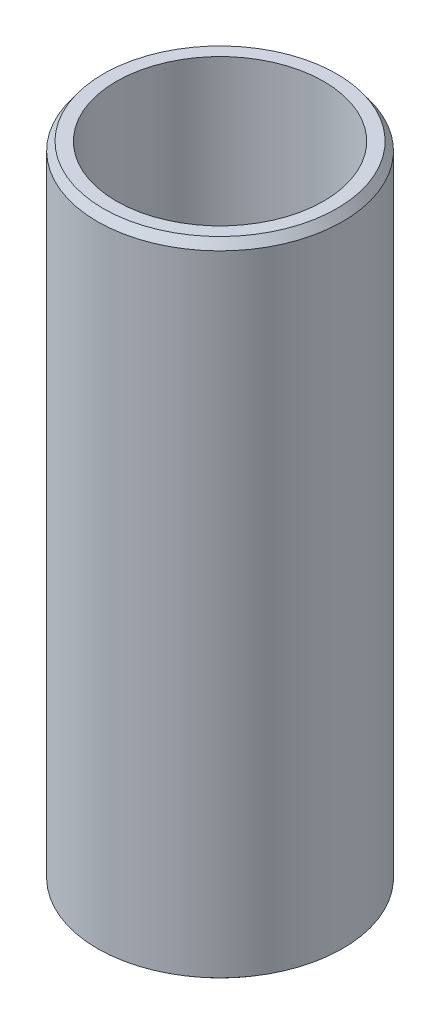
ISO-10303-21;
HEADER;
FILE_DESCRIPTION(('STEP AP214'),'2;1');
FILE_NAME('part.step','',(''),(''),'','','');
FILE_SCHEMA(('AUTOMOTIVE_DESIGN { 1 0 10303 214 1 1 1 1 }'));
ENDSEC;
DATA;
#1=APPLICATION_CONTEXT('core data for automotive mechanical design processes');
#2=APPLICATION_PROTOCOL_DEFINITION('international standard','automotive_design',2000,#1);
#3=PRODUCT_CONTEXT('',#1,'mechanical');
#4=PRODUCT('Part','Part','',(#3));
#5=PRODUCT_RELATED_PRODUCT_CATEGORY('part','',(#4));
#6=PRODUCT_DEFINITION_FORMATION('','',#4);
#7=PRODUCT_DEFINITION_CONTEXT('part definition',#1,'design');
#8=PRODUCT_DEFINITION('design','',#6,#7);
#9=PRODUCT_DEFINITION_SHAPE('','',#8);
#10=(LENGTH_UNIT() NAMED_UNIT(*) SI_UNIT(.MILLI.,.METRE.));
#11=(NAMED_UNIT(*) PLANE_ANGLE_UNIT() SI_UNIT($,.RADIAN.));
#12=(NAMED_UNIT(*) SI_UNIT($,.STERADIAN.) SOLID_ANGLE_UNIT());
#13=UNCERTAINTY_MEASURE_WITH_UNIT(LENGTH_MEASURE(1.E-05),#10,'distance_accuracy_value','');
#14=(GEOMETRIC_REPRESENTATION_CONTEXT(3) GLOBAL_UNCERTAINTY_ASSIGNED_CONTEXT((#13)) GLOBAL_UNIT_ASSIGNED_CONTEXT((#10,
#11,#12)) REPRESENTATION_CONTEXT('',''));
#15=CARTESIAN_POINT('',(0.,0.,0.));
#16=DIRECTION('',(0.,0.,1.));
#17=DIRECTION('',(1.,0.,0.));
#18=AXIS2_PLACEMENT_3D('',#15,#16,#17);
#19=CARTESIAN_POINT('',(0.,301.835364918024,0.));
#20=DIRECTION('',(0.,-1.,0.));
#21=DIRECTION('',(0.,0.,-1.));
#22=AXIS2_PLACEMENT_3D('',#19,#20,#21);
#23=CYLINDRICAL_SURFACE('',#22,57.5);
#24=CARTESIAN_POINT('',(0.,297.959976466155,0.));
#25=DIRECTION('',(0.,1.,0.));
#26=DIRECTION('',(0.,0.,1.));
#27=AXIS2_PLACEMENT_3D('',#24,#25,#26);
#28=CIRCLE('',#27,57.5);
#29=CARTESIAN_POINT('',(0.,297.959976466155,57.5));
#30=VERTEX_POINT('',#29);
#31=EDGE_CURVE('E50',#30,#30,#28,.F.);
#32=ORIENTED_EDGE('',*,*,#31,.T.);
#33=EDGE_LOOP('',(#32));
#34=FACE_BOUND('',#33,.T.);
#35=CARTESIAN_POINT('',(0.,2.77706266600375,0.));
#36=DIRECTION('',(0.,1.,0.));
#37=DIRECTION('',(0.,0.,1.));
#38=AXIS2_PLACEMENT_3D('',#35,#36,#37);
#39=CIRCLE('',#38,57.5);
#40=CARTESIAN_POINT('',(0.,2.77706266600375,57.5));
#41=VERTEX_POINT('',#40);
#42=EDGE_CURVE('E51',#41,#41,#39,.T.);
#43=ORIENTED_EDGE('',*,*,#42,.T.);
#44=EDGE_LOOP('',(#43));
#45=FACE_BOUND('',#44,.T.);
#46=ADVANCED_FACE('F39',(#34,#45),#23,.T.);
#47=CARTESIAN_POINT('',(0.,301.835364918024,0.));
#48=DIRECTION('',(0.,1.,0.));
#49=DIRECTION('',(0.,0.,1.));
#50=AXIS2_PLACEMENT_3D('',#47,#48,#49);
#51=PLANE('',#50);
#52=CARTESIAN_POINT('',(0.,301.835364918024,0.));
#53=DIRECTION('',(0.,1.,0.));
#54=DIRECTION('',(0.,0.,1.));
#55=AXIS2_PLACEMENT_3D('',#52,#53,#54);
#56=CIRCLE('',#55,54.7229373339962);
#57=CARTESIAN_POINT('',(0.,301.835364918024,54.7229373339962));
#58=VERTEX_POINT('',#57);
#59=EDGE_CURVE('E54',#58,#58,#56,.T.);
#60=ORIENTED_EDGE('',*,*,#59,.T.);
#61=EDGE_LOOP('',(#60));
#62=FACE_BOUND('',#61,.T.);
#63=CARTESIAN_POINT('',(0.,301.835364918024,0.));
#64=DIRECTION('',(0.,1.,0.));
#65=DIRECTION('',(0.,0.,1.));
#66=AXIS2_PLACEMENT_3D('',#63,#64,#65);
#67=CIRCLE('',#66,48.6316878636798);
#68=CARTESIAN_POINT('',(0.,301.835364918024,48.6316878636798));
#69=VERTEX_POINT('',#68);
#70=EDGE_CURVE('E58',#69,#69,#67,.T.);
#71=ORIENTED_EDGE('',*,*,#70,.F.);
#72=EDGE_LOOP('',(#71));
#73=FACE_BOUND('',#72,.T.);
#74=ADVANCED_FACE('F69',(#62,#73),#51,.T.);
#75=CARTESIAN_POINT('',(0.,0.,0.));
#76=DIRECTION('',(0.,1.,0.));
#77=DIRECTION('',(0.,0.,1.));
#78=AXIS2_PLACEMENT_3D('',#75,#76,#77);
#79=PLANE('',#78);
#80=CARTESIAN_POINT('',(0.,0.,0.));
#81=DIRECTION('',(0.,1.,0.));
#82=DIRECTION('',(0.,0.,1.));
#83=AXIS2_PLACEMENT_3D('',#80,#81,#82);
#84=CIRCLE('',#83,53.6246115481306);
#85=CARTESIAN_POINT('',(0.,0.,53.6246115481306));
#86=VERTEX_POINT('',#85);
#87=EDGE_CURVE('E10',#86,#86,#84,.F.);
#88=ORIENTED_EDGE('',*,*,#87,.T.);
#89=EDGE_LOOP('',(#88));
#90=FACE_BOUND('',#89,.T.);
#91=CARTESIAN_POINT('',(0.,0.,0.));
#92=DIRECTION('',(0.,1.,0.));
#93=DIRECTION('',(0.,0.,1.));
#94=AXIS2_PLACEMENT_3D('',#91,#92,#93);
#95=CIRCLE('',#94,48.6316878636798);
#96=CARTESIAN_POINT('',(0.,0.,48.6316878636798));
#97=VERTEX_POINT('',#96);
#98=EDGE_CURVE('E63',#97,#97,#95,.T.);
#99=ORIENTED_EDGE('',*,*,#98,.T.);
#100=EDGE_LOOP('',(#99));
#101=FACE_BOUND('',#100,.T.);
#102=ADVANCED_FACE('F75',(#90,#101),#79,.F.);
#103=CARTESIAN_POINT('',(0.,301.835364918024,0.));
#104=DIRECTION('',(0.,-1.,0.));
#105=DIRECTION('',(0.,0.,-1.));
#106=AXIS2_PLACEMENT_3D('',#103,#104,#105);
#107=CYLINDRICAL_SURFACE('',#106,48.6316878636798);
#108=ORIENTED_EDGE('',*,*,#70,.T.);
#109=EDGE_LOOP('',(#108));
#110=FACE_BOUND('',#109,.T.);
#111=ORIENTED_EDGE('',*,*,#98,.F.);
#112=EDGE_LOOP('',(#111));
#113=FACE_BOUND('',#112,.T.);
#114=ADVANCED_FACE('F70',(#110,#113),#107,.F.);
#115=CARTESIAN_POINT('',(0.,301.835364918024,0.));
#116=DIRECTION('',(0.,-1.,0.));
#117=DIRECTION('',(0.,0.,-1.));
#118=AXIS2_PLACEMENT_3D('',#115,#116,#117);
#119=CONICAL_SURFACE('',#118,54.7229373339962,0.621773302938266);
#120=ORIENTED_EDGE('',*,*,#31,.F.);
#121=EDGE_LOOP('',(#120));
#122=FACE_BOUND('',#121,.T.);
#123=ORIENTED_EDGE('',*,*,#59,.F.);
#124=EDGE_LOOP('',(#123));
#125=FACE_BOUND('',#124,.T.);
#126=ADVANCED_FACE('F81',(#122,#125),#119,.T.);
#127=CARTESIAN_POINT('',(0.,2.77706266600375,0.));
#128=DIRECTION('',(0.,1.,0.));
#129=DIRECTION('',(0.,0.,1.));
#130=AXIS2_PLACEMENT_3D('',#127,#128,#129);
#131=CONICAL_SURFACE('',#130,57.5,0.949023023856639);
#132=ORIENTED_EDGE('',*,*,#87,.F.);
#133=EDGE_LOOP('',(#132));
#134=FACE_BOUND('',#133,.T.);
#135=ORIENTED_EDGE('',*,*,#42,.F.);
#136=EDGE_LOOP('',(#135));
#137=FACE_BOUND('',#136,.T.);
#138=ADVANCED_FACE('F45',(#134,#137),#131,.T.);
#139=CLOSED_SHELL('',(#46,#74,#102,#114,#126,#138));
#140=MANIFOLD_SOLID_BREP('B2',#139);
#141=ADVANCED_BREP_SHAPE_REPRESENTATION('',(#18,#140),#14);
#142=SHAPE_DEFINITION_REPRESENTATION(#9,#141);
ENDSEC;
END-ISO-10303-21;
